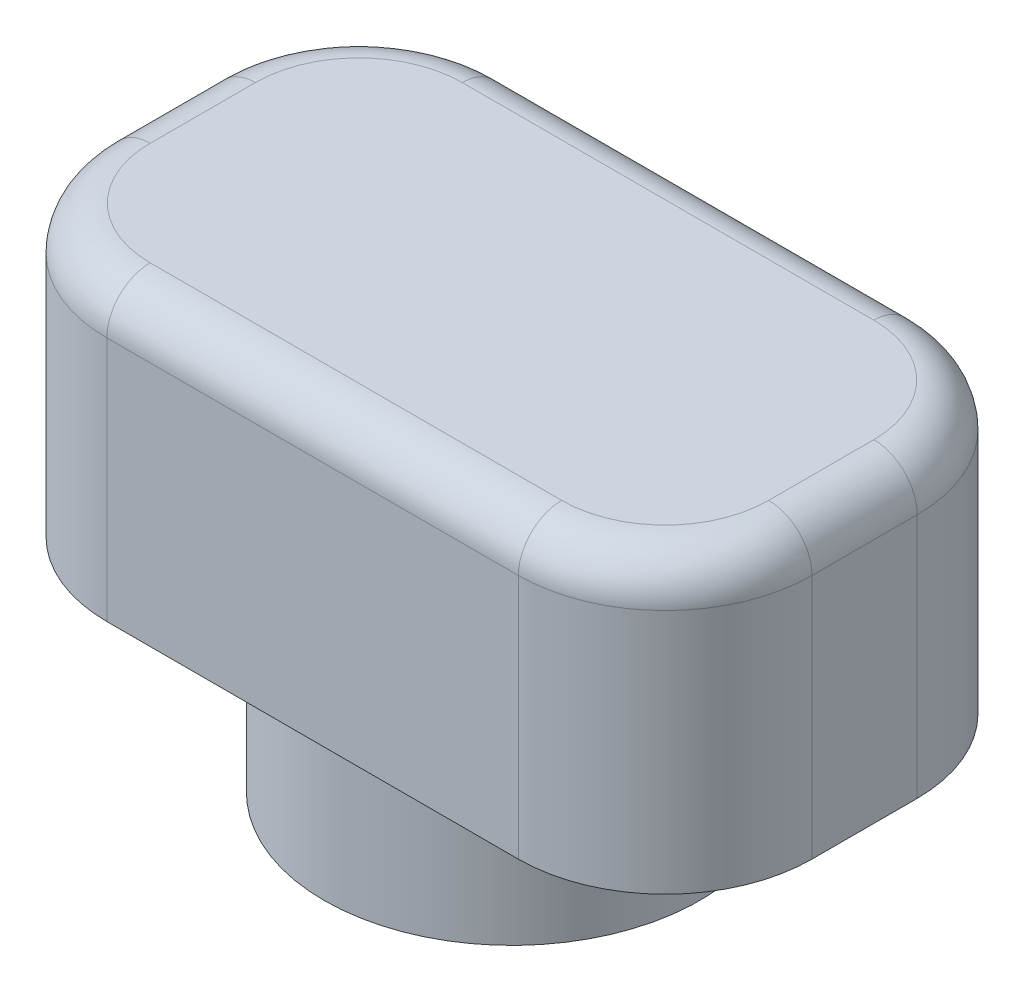
ISO-10303-21;
HEADER;
FILE_DESCRIPTION(('STEP AP214'),'2;1');
FILE_NAME('part.step','',(''),(''),'','','');
FILE_SCHEMA(('AUTOMOTIVE_DESIGN { 1 0 10303 214 1 1 1 1 }'));
ENDSEC;
DATA;
#1=APPLICATION_CONTEXT('core data for automotive mechanical design processes');
#2=APPLICATION_PROTOCOL_DEFINITION('international standard','automotive_design',2000,#1);
#3=PRODUCT_CONTEXT('',#1,'mechanical');
#4=PRODUCT('Part','Part','',(#3));
#5=PRODUCT_RELATED_PRODUCT_CATEGORY('part','',(#4));
#6=PRODUCT_DEFINITION_FORMATION('','',#4);
#7=PRODUCT_DEFINITION_CONTEXT('part definition',#1,'design');
#8=PRODUCT_DEFINITION('design','',#6,#7);
#9=PRODUCT_DEFINITION_SHAPE('','',#8);
#10=(LENGTH_UNIT() NAMED_UNIT(*) SI_UNIT(.MILLI.,.METRE.));
#11=(NAMED_UNIT(*) PLANE_ANGLE_UNIT() SI_UNIT($,.RADIAN.));
#12=(NAMED_UNIT(*) SI_UNIT($,.STERADIAN.) SOLID_ANGLE_UNIT());
#13=UNCERTAINTY_MEASURE_WITH_UNIT(LENGTH_MEASURE(1.E-05),#10,'distance_accuracy_value','');
#14=(GEOMETRIC_REPRESENTATION_CONTEXT(3) GLOBAL_UNCERTAINTY_ASSIGNED_CONTEXT((#13)) GLOBAL_UNIT_ASSIGNED_CONTEXT((#10,
#11,#12)) REPRESENTATION_CONTEXT('',''));
#15=CARTESIAN_POINT('',(0.,0.,0.));
#16=DIRECTION('',(0.,0.,1.));
#17=DIRECTION('',(1.,0.,0.));
#18=AXIS2_PLACEMENT_3D('',#15,#16,#17);
#19=CARTESIAN_POINT('',(0.,2.5,0.));
#20=DIRECTION('',(0.,-1.,0.));
#21=DIRECTION('',(0.,0.,-1.));
#22=AXIS2_PLACEMENT_3D('',#19,#20,#21);
#23=CYLINDRICAL_SURFACE('',#22,3.25);
#24=CARTESIAN_POINT('',(0.,2.5,0.));
#25=DIRECTION('',(0.,1.,0.));
#26=DIRECTION('',(0.,0.,1.));
#27=AXIS2_PLACEMENT_3D('',#24,#25,#26);
#28=CIRCLE('',#27,3.25);
#29=CARTESIAN_POINT('',(0.,2.5,3.25));
#30=VERTEX_POINT('',#29);
#31=EDGE_CURVE('E187',#30,#30,#28,.T.);
#32=ORIENTED_EDGE('',*,*,#31,.F.);
#33=EDGE_LOOP('',(#32));
#34=FACE_BOUND('',#33,.T.);
#35=CARTESIAN_POINT('',(0.,0.,0.));
#36=DIRECTION('',(0.,1.,0.));
#37=DIRECTION('',(0.,0.,1.));
#38=AXIS2_PLACEMENT_3D('',#35,#36,#37);
#39=CIRCLE('',#38,3.25);
#40=CARTESIAN_POINT('',(0.,0.,3.25));
#41=VERTEX_POINT('',#40);
#42=EDGE_CURVE('E183',#41,#41,#39,.T.);
#43=ORIENTED_EDGE('',*,*,#42,.T.);
#44=EDGE_LOOP('',(#43));
#45=FACE_BOUND('',#44,.T.);
#46=ADVANCED_FACE('F47',(#34,#45),#23,.T.);
#47=CARTESIAN_POINT('',(0.,0.,0.));
#48=DIRECTION('',(0.,1.,0.));
#49=DIRECTION('',(0.,0.,1.));
#50=AXIS2_PLACEMENT_3D('',#47,#48,#49);
#51=PLANE('',#50);
#52=CARTESIAN_POINT('',(0.,0.,0.));
#53=DIRECTION('',(0.,-1.,0.));
#54=DIRECTION('',(0.,0.,-1.));
#55=AXIS2_PLACEMENT_3D('',#52,#53,#54);
#56=CIRCLE('',#55,1.75);
#57=CARTESIAN_POINT('',(0.,0.,-1.75));
#58=VERTEX_POINT('',#57);
#59=EDGE_CURVE('E173',#58,#58,#56,.T.);
#60=ORIENTED_EDGE('',*,*,#59,.F.);
#61=EDGE_LOOP('',(#60));
#62=FACE_BOUND('',#61,.T.);
#63=ORIENTED_EDGE('',*,*,#42,.F.);
#64=EDGE_LOOP('',(#63));
#65=FACE_BOUND('',#64,.T.);
#66=ADVANCED_FACE('F354',(#62,#65),#51,.F.);
#67=CARTESIAN_POINT('',(0.,2.5,0.));
#68=DIRECTION('',(0.,-1.,0.));
#69=DIRECTION('',(0.,0.,-1.));
#70=AXIS2_PLACEMENT_3D('',#67,#68,#69);
#71=CYLINDRICAL_SURFACE('',#70,1.75);
#72=CARTESIAN_POINT('',(0.,2.5,0.));
#73=DIRECTION('',(0.,-1.,0.));
#74=DIRECTION('',(0.,0.,-1.));
#75=AXIS2_PLACEMENT_3D('',#72,#73,#74);
#76=CIRCLE('',#75,1.75);
#77=CARTESIAN_POINT('',(0.,2.5,-1.75));
#78=VERTEX_POINT('',#77);
#79=EDGE_CURVE('E179',#78,#78,#76,.T.);
#80=ORIENTED_EDGE('',*,*,#79,.F.);
#81=EDGE_LOOP('',(#80));
#82=FACE_BOUND('',#81,.T.);
#83=ORIENTED_EDGE('',*,*,#59,.T.);
#84=EDGE_LOOP('',(#83));
#85=FACE_BOUND('',#84,.T.);
#86=ADVANCED_FACE('F360',(#82,#85),#71,.F.);
#87=CARTESIAN_POINT('',(0.,2.5,0.));
#88=DIRECTION('',(0.,1.,0.));
#89=DIRECTION('',(0.,0.,1.));
#90=AXIS2_PLACEMENT_3D('',#87,#88,#89);
#91=PLANE('',#90);
#92=ORIENTED_EDGE('',*,*,#31,.T.);
#93=EDGE_LOOP('',(#92));
#94=FACE_BOUND('',#93,.T.);
#95=DIRECTION('',(0.,0.,1.));
#96=VECTOR('',#95,1.);
#97=CARTESIAN_POINT('',(-6.1,2.5,-3.45));
#98=LINE('',#97,#96);
#99=CARTESIAN_POINT('',(-6.1,2.5,-0.909999999999998));
#100=VERTEX_POINT('',#99);
#101=CARTESIAN_POINT('',(-6.1,2.5,0.910000000000001));
#102=VERTEX_POINT('',#101);
#103=EDGE_CURVE('E142',#100,#102,#98,.T.);
#104=ORIENTED_EDGE('',*,*,#103,.F.);
#105=CARTESIAN_POINT('',(-3.56,2.5,-0.909999999999999));
#106=DIRECTION('',(0.,1.,0.));
#107=DIRECTION('',(0.,0.,1.));
#108=AXIS2_PLACEMENT_3D('',#105,#106,#107);
#109=CIRCLE('',#108,2.54);
#110=CARTESIAN_POINT('',(-3.56,2.5,-3.45));
#111=VERTEX_POINT('',#110);
#112=EDGE_CURVE('E152',#100,#111,#109,.F.);
#113=ORIENTED_EDGE('',*,*,#112,.T.);
#114=DIRECTION('',(-1.,0.,0.));
#115=VECTOR('',#114,1.);
#116=CARTESIAN_POINT('',(-6.1,2.5,-3.45));
#117=LINE('',#116,#115);
#118=CARTESIAN_POINT('',(3.56,2.5,-3.45));
#119=VERTEX_POINT('',#118);
#120=EDGE_CURVE('E168',#119,#111,#117,.T.);
#121=ORIENTED_EDGE('',*,*,#120,.F.);
#122=CARTESIAN_POINT('',(3.56,2.5,-0.909999999999999));
#123=DIRECTION('',(0.,1.,0.));
#124=DIRECTION('',(0.,0.,1.));
#125=AXIS2_PLACEMENT_3D('',#122,#123,#124);
#126=CIRCLE('',#125,2.54);
#127=CARTESIAN_POINT('',(6.1,2.5,-0.909999999999999));
#128=VERTEX_POINT('',#127);
#129=EDGE_CURVE('E161',#119,#128,#126,.F.);
#130=ORIENTED_EDGE('',*,*,#129,.T.);
#131=DIRECTION('',(0.,0.,-1.));
#132=VECTOR('',#131,1.);
#133=CARTESIAN_POINT('',(6.1,2.5,-3.45));
#134=LINE('',#133,#132);
#135=CARTESIAN_POINT('',(6.1,2.5,0.910000000000001));
#136=VERTEX_POINT('',#135);
#137=EDGE_CURVE('E175',#136,#128,#134,.T.);
#138=ORIENTED_EDGE('',*,*,#137,.F.);
#139=CARTESIAN_POINT('',(3.56,2.5,0.910000000000001));
#140=DIRECTION('',(0.,1.,0.));
#141=DIRECTION('',(0.,0.,1.));
#142=AXIS2_PLACEMENT_3D('',#139,#140,#141);
#143=CIRCLE('',#142,2.54);
#144=CARTESIAN_POINT('',(3.56,2.5,3.45));
#145=VERTEX_POINT('',#144);
#146=EDGE_CURVE('E198',#136,#145,#143,.F.);
#147=ORIENTED_EDGE('',*,*,#146,.T.);
#148=DIRECTION('',(1.,0.,0.));
#149=VECTOR('',#148,1.);
#150=CARTESIAN_POINT('',(-6.1,2.5,3.45));
#151=LINE('',#150,#149);
#152=CARTESIAN_POINT('',(-3.56,2.5,3.45));
#153=VERTEX_POINT('',#152);
#154=EDGE_CURVE('E167',#153,#145,#151,.T.);
#155=ORIENTED_EDGE('',*,*,#154,.F.);
#156=CARTESIAN_POINT('',(-3.56,2.5,0.910000000000001));
#157=DIRECTION('',(0.,1.,0.));
#158=DIRECTION('',(0.,0.,1.));
#159=AXIS2_PLACEMENT_3D('',#156,#157,#158);
#160=CIRCLE('',#159,2.54);
#161=EDGE_CURVE('E148',#153,#102,#160,.F.);
#162=ORIENTED_EDGE('',*,*,#161,.T.);
#163=EDGE_LOOP('',(#104,#113,#121,#130,#138,#147,#155,#162));
#164=FACE_BOUND('',#163,.T.);
#165=ADVANCED_FACE('F163',(#94,#164),#91,.F.);
#166=CARTESIAN_POINT('',(0.,7.5,0.));
#167=DIRECTION('',(0.,1.,0.));
#168=DIRECTION('',(0.,0.,1.));
#169=AXIS2_PLACEMENT_3D('',#166,#167,#168);
#170=PLANE('',#169);
#171=CARTESIAN_POINT('',(3.56,7.5,0.910000000000001));
#172=DIRECTION('',(0.,1.,0.));
#173=DIRECTION('',(0.,0.,1.));
#174=AXIS2_PLACEMENT_3D('',#171,#172,#173);
#175=CIRCLE('',#174,1.79);
#176=CARTESIAN_POINT('',(3.56,7.5,2.7));
#177=VERTEX_POINT('',#176);
#178=CARTESIAN_POINT('',(5.35,7.5,0.910000000000001));
#179=VERTEX_POINT('',#178);
#180=EDGE_CURVE('E238',#177,#179,#175,.T.);
#181=ORIENTED_EDGE('',*,*,#180,.T.);
#182=DIRECTION('',(0.,0.,-1.));
#183=VECTOR('',#182,1.);
#184=CARTESIAN_POINT('',(5.35,7.5,-0.909999999999999));
#185=LINE('',#184,#183);
#186=CARTESIAN_POINT('',(5.35,7.5,-0.909999999999999));
#187=VERTEX_POINT('',#186);
#188=EDGE_CURVE('E241',#179,#187,#185,.T.);
#189=ORIENTED_EDGE('',*,*,#188,.T.);
#190=CARTESIAN_POINT('',(3.56,7.5,-0.909999999999999));
#191=DIRECTION('',(0.,1.,0.));
#192=DIRECTION('',(0.,0.,1.));
#193=AXIS2_PLACEMENT_3D('',#190,#191,#192);
#194=CIRCLE('',#193,1.79);
#195=CARTESIAN_POINT('',(3.56,7.5,-2.7));
#196=VERTEX_POINT('',#195);
#197=EDGE_CURVE('E235',#187,#196,#194,.T.);
#198=ORIENTED_EDGE('',*,*,#197,.T.);
#199=DIRECTION('',(-1.,0.,0.));
#200=VECTOR('',#199,1.);
#201=CARTESIAN_POINT('',(-3.56,7.5,-2.7));
#202=LINE('',#201,#200);
#203=CARTESIAN_POINT('',(-3.56,7.5,-2.7));
#204=VERTEX_POINT('',#203);
#205=EDGE_CURVE('E232',#196,#204,#202,.T.);
#206=ORIENTED_EDGE('',*,*,#205,.T.);
#207=CARTESIAN_POINT('',(-3.56,7.5,-0.909999999999999));
#208=DIRECTION('',(0.,1.,0.));
#209=DIRECTION('',(0.,0.,1.));
#210=AXIS2_PLACEMENT_3D('',#207,#208,#209);
#211=CIRCLE('',#210,1.79);
#212=CARTESIAN_POINT('',(-5.35,7.5,-0.909999999999999));
#213=VERTEX_POINT('',#212);
#214=EDGE_CURVE('E229',#204,#213,#211,.T.);
#215=ORIENTED_EDGE('',*,*,#214,.T.);
#216=DIRECTION('',(0.,0.,1.));
#217=VECTOR('',#216,1.);
#218=CARTESIAN_POINT('',(-5.35,7.5,0.910000000000001));
#219=LINE('',#218,#217);
#220=CARTESIAN_POINT('',(-5.35,7.5,0.910000000000001));
#221=VERTEX_POINT('',#220);
#222=EDGE_CURVE('E226',#213,#221,#219,.T.);
#223=ORIENTED_EDGE('',*,*,#222,.T.);
#224=CARTESIAN_POINT('',(-3.56,7.5,0.910000000000001));
#225=DIRECTION('',(0.,1.,0.));
#226=DIRECTION('',(0.,0.,1.));
#227=AXIS2_PLACEMENT_3D('',#224,#225,#226);
#228=CIRCLE('',#227,1.79);
#229=CARTESIAN_POINT('',(-3.56,7.5,2.7));
#230=VERTEX_POINT('',#229);
#231=EDGE_CURVE('E223',#221,#230,#228,.T.);
#232=ORIENTED_EDGE('',*,*,#231,.T.);
#233=DIRECTION('',(1.,0.,0.));
#234=VECTOR('',#233,1.);
#235=CARTESIAN_POINT('',(3.56,7.5,2.7));
#236=LINE('',#235,#234);
#237=EDGE_CURVE('E220',#230,#177,#236,.T.);
#238=ORIENTED_EDGE('',*,*,#237,.T.);
#239=EDGE_LOOP('',(#181,#189,#198,#206,#215,#223,#232,#238));
#240=FACE_BOUND('',#239,.T.);
#241=ADVANCED_FACE('F337',(#240),#170,.T.);
#242=CARTESIAN_POINT('',(-6.1,7.5,3.45));
#243=DIRECTION('',(0.,0.,-1.));
#244=DIRECTION('',(-1.,0.,0.));
#245=AXIS2_PLACEMENT_3D('',#242,#243,#244);
#246=PLANE('',#245);
#247=DIRECTION('',(0.,-1.,0.));
#248=VECTOR('',#247,1.);
#249=CARTESIAN_POINT('',(3.56,7.5,3.45));
#250=LINE('',#249,#248);
#251=CARTESIAN_POINT('',(3.56,6.75,3.45));
#252=VERTEX_POINT('',#251);
#253=EDGE_CURVE('E217',#145,#252,#250,.F.);
#254=ORIENTED_EDGE('',*,*,#253,.T.);
#255=DIRECTION('',(1.,0.,0.));
#256=VECTOR('',#255,1.);
#257=CARTESIAN_POINT('',(-3.56,6.75,3.45));
#258=LINE('',#257,#256);
#259=CARTESIAN_POINT('',(-3.56,6.75,3.45));
#260=VERTEX_POINT('',#259);
#261=EDGE_CURVE('E11',#252,#260,#258,.F.);
#262=ORIENTED_EDGE('',*,*,#261,.T.);
#263=DIRECTION('',(0.,-1.,0.));
#264=VECTOR('',#263,1.);
#265=CARTESIAN_POINT('',(-3.56,7.5,3.45));
#266=LINE('',#265,#264);
#267=EDGE_CURVE('E214',#260,#153,#266,.T.);
#268=ORIENTED_EDGE('',*,*,#267,.T.);
#269=ORIENTED_EDGE('',*,*,#154,.T.);
#270=EDGE_LOOP('',(#254,#262,#268,#269));
#271=FACE_BOUND('',#270,.T.);
#272=ADVANCED_FACE('F324',(#271),#246,.F.);
#273=CARTESIAN_POINT('',(-6.1,7.5,-3.45));
#274=DIRECTION('',(1.,0.,0.));
#275=DIRECTION('',(0.,0.,-1.));
#276=AXIS2_PLACEMENT_3D('',#273,#274,#275);
#277=PLANE('',#276);
#278=DIRECTION('',(0.,-1.,0.));
#279=VECTOR('',#278,1.);
#280=CARTESIAN_POINT('',(-6.1,7.5,0.910000000000001));
#281=LINE('',#280,#279);
#282=CARTESIAN_POINT('',(-6.1,6.75,0.910000000000001));
#283=VERTEX_POINT('',#282);
#284=EDGE_CURVE('E149',#102,#283,#281,.F.);
#285=ORIENTED_EDGE('',*,*,#284,.T.);
#286=DIRECTION('',(0.,0.,1.));
#287=VECTOR('',#286,1.);
#288=CARTESIAN_POINT('',(-6.1,6.75,-0.909999999999998));
#289=LINE('',#288,#287);
#290=CARTESIAN_POINT('',(-6.1,6.75,-0.909999999999998));
#291=VERTEX_POINT('',#290);
#292=EDGE_CURVE('E144',#283,#291,#289,.F.);
#293=ORIENTED_EDGE('',*,*,#292,.T.);
#294=DIRECTION('',(0.,-1.,0.));
#295=VECTOR('',#294,1.);
#296=CARTESIAN_POINT('',(-6.1,7.5,-0.909999999999998));
#297=LINE('',#296,#295);
#298=EDGE_CURVE('E138',#291,#100,#297,.T.);
#299=ORIENTED_EDGE('',*,*,#298,.T.);
#300=ORIENTED_EDGE('',*,*,#103,.T.);
#301=EDGE_LOOP('',(#285,#293,#299,#300));
#302=FACE_BOUND('',#301,.T.);
#303=ADVANCED_FACE('F140',(#302),#277,.F.);
#304=CARTESIAN_POINT('',(-6.1,7.5,-3.45));
#305=DIRECTION('',(0.,0.,1.));
#306=DIRECTION('',(1.,0.,0.));
#307=AXIS2_PLACEMENT_3D('',#304,#305,#306);
#308=PLANE('',#307);
#309=DIRECTION('',(0.,-1.,0.));
#310=VECTOR('',#309,1.);
#311=CARTESIAN_POINT('',(-3.56,7.5,-3.45));
#312=LINE('',#311,#310);
#313=CARTESIAN_POINT('',(-3.56,6.75,-3.45));
#314=VERTEX_POINT('',#313);
#315=EDGE_CURVE('E155',#111,#314,#312,.F.);
#316=ORIENTED_EDGE('',*,*,#315,.T.);
#317=DIRECTION('',(-1.,0.,0.));
#318=VECTOR('',#317,1.);
#319=CARTESIAN_POINT('',(3.56,6.75,-3.45));
#320=LINE('',#319,#318);
#321=CARTESIAN_POINT('',(3.56,6.75,-3.45));
#322=VERTEX_POINT('',#321);
#323=EDGE_CURVE('E255',#314,#322,#320,.F.);
#324=ORIENTED_EDGE('',*,*,#323,.T.);
#325=DIRECTION('',(0.,-1.,0.));
#326=VECTOR('',#325,1.);
#327=CARTESIAN_POINT('',(3.56,7.5,-3.45));
#328=LINE('',#327,#326);
#329=EDGE_CURVE('E160',#322,#119,#328,.T.);
#330=ORIENTED_EDGE('',*,*,#329,.T.);
#331=ORIENTED_EDGE('',*,*,#120,.T.);
#332=EDGE_LOOP('',(#316,#324,#330,#331));
#333=FACE_BOUND('',#332,.T.);
#334=ADVANCED_FACE('F332',(#333),#308,.F.);
#335=CARTESIAN_POINT('',(6.1,7.5,-3.45));
#336=DIRECTION('',(-1.,0.,0.));
#337=DIRECTION('',(0.,0.,1.));
#338=AXIS2_PLACEMENT_3D('',#335,#336,#337);
#339=PLANE('',#338);
#340=DIRECTION('',(0.,-1.,0.));
#341=VECTOR('',#340,1.);
#342=CARTESIAN_POINT('',(6.1,7.5,-0.909999999999999));
#343=LINE('',#342,#341);
#344=CARTESIAN_POINT('',(6.1,6.75,-0.909999999999999));
#345=VERTEX_POINT('',#344);
#346=EDGE_CURVE('E210',#128,#345,#343,.F.);
#347=ORIENTED_EDGE('',*,*,#346,.T.);
#348=DIRECTION('',(0.,0.,-1.));
#349=VECTOR('',#348,1.);
#350=CARTESIAN_POINT('',(6.1,6.75,0.910000000000001));
#351=LINE('',#350,#349);
#352=CARTESIAN_POINT('',(6.1,6.75,0.910000000000001));
#353=VERTEX_POINT('',#352);
#354=EDGE_CURVE('E245',#345,#353,#351,.F.);
#355=ORIENTED_EDGE('',*,*,#354,.T.);
#356=DIRECTION('',(0.,-1.,0.));
#357=VECTOR('',#356,1.);
#358=CARTESIAN_POINT('',(6.1,7.5,0.910000000000001));
#359=LINE('',#358,#357);
#360=EDGE_CURVE('E207',#353,#136,#359,.T.);
#361=ORIENTED_EDGE('',*,*,#360,.T.);
#362=ORIENTED_EDGE('',*,*,#137,.T.);
#363=EDGE_LOOP('',(#347,#355,#361,#362));
#364=FACE_BOUND('',#363,.T.);
#365=ADVANCED_FACE('F302',(#364),#339,.F.);
#366=ORIENTED_EDGE('',*,*,#79,.T.);
#367=EDGE_LOOP('',(#366));
#368=FACE_BOUND('',#367,.T.);
#369=ADVANCED_FACE('F369',(#368),#91,.F.);
#370=CARTESIAN_POINT('',(-3.56,7.5,-0.909999999999999));
#371=DIRECTION('',(0.,-1.,0.));
#372=DIRECTION('',(0.,0.,-1.));
#373=AXIS2_PLACEMENT_3D('',#370,#371,#372);
#374=CYLINDRICAL_SURFACE('',#373,2.54);
#375=ORIENTED_EDGE('',*,*,#298,.F.);
#376=CARTESIAN_POINT('',(-3.56,6.75,-0.909999999999999));
#377=DIRECTION('',(0.,1.,0.));
#378=DIRECTION('',(0.,0.,1.));
#379=AXIS2_PLACEMENT_3D('',#376,#377,#378);
#380=CIRCLE('',#379,2.54);
#381=EDGE_CURVE('E258',#291,#314,#380,.F.);
#382=ORIENTED_EDGE('',*,*,#381,.T.);
#383=ORIENTED_EDGE('',*,*,#315,.F.);
#384=ORIENTED_EDGE('',*,*,#112,.F.);
#385=EDGE_LOOP('',(#375,#382,#383,#384));
#386=FACE_BOUND('',#385,.T.);
#387=ADVANCED_FACE('F153',(#386),#374,.T.);
#388=CARTESIAN_POINT('',(3.56,7.5,-0.909999999999999));
#389=DIRECTION('',(0.,-1.,0.));
#390=DIRECTION('',(0.,0.,-1.));
#391=AXIS2_PLACEMENT_3D('',#388,#389,#390);
#392=CYLINDRICAL_SURFACE('',#391,2.54);
#393=ORIENTED_EDGE('',*,*,#329,.F.);
#394=CARTESIAN_POINT('',(3.56,6.75,-0.909999999999999));
#395=DIRECTION('',(0.,1.,0.));
#396=DIRECTION('',(0.,0.,1.));
#397=AXIS2_PLACEMENT_3D('',#394,#395,#396);
#398=CIRCLE('',#397,2.54);
#399=EDGE_CURVE('E252',#322,#345,#398,.F.);
#400=ORIENTED_EDGE('',*,*,#399,.T.);
#401=ORIENTED_EDGE('',*,*,#346,.F.);
#402=ORIENTED_EDGE('',*,*,#129,.F.);
#403=EDGE_LOOP('',(#393,#400,#401,#402));
#404=FACE_BOUND('',#403,.T.);
#405=ADVANCED_FACE('F309',(#404),#392,.T.);
#406=CARTESIAN_POINT('',(3.56,7.5,0.910000000000001));
#407=DIRECTION('',(0.,-1.,0.));
#408=DIRECTION('',(0.,0.,-1.));
#409=AXIS2_PLACEMENT_3D('',#406,#407,#408);
#410=CYLINDRICAL_SURFACE('',#409,2.54);
#411=ORIENTED_EDGE('',*,*,#360,.F.);
#412=CARTESIAN_POINT('',(3.56,6.75,0.910000000000001));
#413=DIRECTION('',(0.,1.,0.));
#414=DIRECTION('',(0.,0.,1.));
#415=AXIS2_PLACEMENT_3D('',#412,#413,#414);
#416=CIRCLE('',#415,2.54);
#417=EDGE_CURVE('E249',#353,#252,#416,.F.);
#418=ORIENTED_EDGE('',*,*,#417,.T.);
#419=ORIENTED_EDGE('',*,*,#253,.F.);
#420=ORIENTED_EDGE('',*,*,#146,.F.);
#421=EDGE_LOOP('',(#411,#418,#419,#420));
#422=FACE_BOUND('',#421,.T.);
#423=ADVANCED_FACE('F322',(#422),#410,.T.);
#424=CARTESIAN_POINT('',(-3.56,7.5,0.910000000000001));
#425=DIRECTION('',(0.,-1.,0.));
#426=DIRECTION('',(0.,0.,-1.));
#427=AXIS2_PLACEMENT_3D('',#424,#425,#426);
#428=CYLINDRICAL_SURFACE('',#427,2.54);
#429=ORIENTED_EDGE('',*,*,#267,.F.);
#430=CARTESIAN_POINT('',(-3.56,6.75,0.910000000000001));
#431=DIRECTION('',(0.,1.,0.));
#432=DIRECTION('',(0.,0.,1.));
#433=AXIS2_PLACEMENT_3D('',#430,#431,#432);
#434=CIRCLE('',#433,2.54);
#435=EDGE_CURVE('E57',#260,#283,#434,.F.);
#436=ORIENTED_EDGE('',*,*,#435,.T.);
#437=ORIENTED_EDGE('',*,*,#284,.F.);
#438=ORIENTED_EDGE('',*,*,#161,.F.);
#439=EDGE_LOOP('',(#429,#436,#437,#438));
#440=FACE_BOUND('',#439,.T.);
#441=ADVANCED_FACE('F325',(#440),#428,.T.);
#442=CARTESIAN_POINT('',(-5.35,6.75,0.));
#443=DIRECTION('',(0.,0.,-1.));
#444=DIRECTION('',(-1.,0.,0.));
#445=AXIS2_PLACEMENT_3D('',#442,#443,#444);
#446=CYLINDRICAL_SURFACE('',#445,0.75);
#447=CARTESIAN_POINT('',(-5.35,6.75,-0.909999999999999));
#448=DIRECTION('',(0.,0.,-1.));
#449=DIRECTION('',(-1.,0.,0.));
#450=AXIS2_PLACEMENT_3D('',#447,#448,#449);
#451=CIRCLE('',#450,0.75);
#452=EDGE_CURVE('E286',#291,#213,#451,.T.);
#453=ORIENTED_EDGE('',*,*,#452,.F.);
#454=ORIENTED_EDGE('',*,*,#292,.F.);
#455=CARTESIAN_POINT('',(-5.35,6.75,0.910000000000001));
#456=DIRECTION('',(0.,0.,1.));
#457=DIRECTION('',(1.,0.,0.));
#458=AXIS2_PLACEMENT_3D('',#455,#456,#457);
#459=CIRCLE('',#458,0.75);
#460=EDGE_CURVE('E51',#221,#283,#459,.T.);
#461=ORIENTED_EDGE('',*,*,#460,.F.);
#462=ORIENTED_EDGE('',*,*,#222,.F.);
#463=EDGE_LOOP('',(#453,#454,#461,#462));
#464=FACE_BOUND('',#463,.T.);
#465=ADVANCED_FACE('F49',(#464),#446,.T.);
#466=CARTESIAN_POINT('',(-3.56,6.75,0.910000000000001));
#467=DIRECTION('',(0.,1.,0.));
#468=DIRECTION('',(0.,0.,1.));
#469=AXIS2_PLACEMENT_3D('',#466,#467,#468);
#470=TOROIDAL_SURFACE('',#469,1.79,0.75);
#471=ORIENTED_EDGE('',*,*,#460,.T.);
#472=ORIENTED_EDGE('',*,*,#435,.F.);
#473=CARTESIAN_POINT('',(-3.56,6.75,2.7));
#474=DIRECTION('',(1.,0.,0.));
#475=DIRECTION('',(0.,0.,-1.));
#476=AXIS2_PLACEMENT_3D('',#473,#474,#475);
#477=CIRCLE('',#476,0.75);
#478=EDGE_CURVE('E283',#230,#260,#477,.T.);
#479=ORIENTED_EDGE('',*,*,#478,.F.);
#480=ORIENTED_EDGE('',*,*,#231,.F.);
#481=EDGE_LOOP('',(#471,#472,#479,#480));
#482=FACE_BOUND('',#481,.T.);
#483=ADVANCED_FACE('F346',(#482),#470,.T.);
#484=CARTESIAN_POINT('',(-3.56,6.75,-0.909999999999999));
#485=DIRECTION('',(0.,1.,0.));
#486=DIRECTION('',(0.,0.,1.));
#487=AXIS2_PLACEMENT_3D('',#484,#485,#486);
#488=TOROIDAL_SURFACE('',#487,1.79,0.75);
#489=ORIENTED_EDGE('',*,*,#452,.T.);
#490=ORIENTED_EDGE('',*,*,#214,.F.);
#491=CARTESIAN_POINT('',(-3.56,6.75,-2.7));
#492=DIRECTION('',(1.,0.,0.));
#493=DIRECTION('',(0.,0.,-1.));
#494=AXIS2_PLACEMENT_3D('',#491,#492,#493);
#495=CIRCLE('',#494,0.75);
#496=EDGE_CURVE('E279',#314,#204,#495,.T.);
#497=ORIENTED_EDGE('',*,*,#496,.F.);
#498=ORIENTED_EDGE('',*,*,#381,.F.);
#499=EDGE_LOOP('',(#489,#490,#497,#498));
#500=FACE_BOUND('',#499,.T.);
#501=ADVANCED_FACE('F329',(#500),#488,.T.);
#502=CARTESIAN_POINT('',(0.,6.75,2.7));
#503=DIRECTION('',(-1.,0.,0.));
#504=DIRECTION('',(0.,0.,1.));
#505=AXIS2_PLACEMENT_3D('',#502,#503,#504);
#506=CYLINDRICAL_SURFACE('',#505,0.75);
#507=ORIENTED_EDGE('',*,*,#478,.T.);
#508=ORIENTED_EDGE('',*,*,#261,.F.);
#509=CARTESIAN_POINT('',(3.56,6.75,2.7));
#510=DIRECTION('',(1.,0.,0.));
#511=DIRECTION('',(0.,0.,-1.));
#512=AXIS2_PLACEMENT_3D('',#509,#510,#511);
#513=CIRCLE('',#512,0.75);
#514=EDGE_CURVE('E275',#177,#252,#513,.T.);
#515=ORIENTED_EDGE('',*,*,#514,.F.);
#516=ORIENTED_EDGE('',*,*,#237,.F.);
#517=EDGE_LOOP('',(#507,#508,#515,#516));
#518=FACE_BOUND('',#517,.T.);
#519=ADVANCED_FACE('F344',(#518),#506,.T.);
#520=CARTESIAN_POINT('',(0.,6.75,-2.7));
#521=DIRECTION('',(1.,0.,0.));
#522=DIRECTION('',(0.,0.,-1.));
#523=AXIS2_PLACEMENT_3D('',#520,#521,#522);
#524=CYLINDRICAL_SURFACE('',#523,0.75);
#525=ORIENTED_EDGE('',*,*,#496,.T.);
#526=ORIENTED_EDGE('',*,*,#205,.F.);
#527=CARTESIAN_POINT('',(3.56,6.75,-2.7));
#528=DIRECTION('',(1.,0.,0.));
#529=DIRECTION('',(0.,0.,-1.));
#530=AXIS2_PLACEMENT_3D('',#527,#528,#529);
#531=CIRCLE('',#530,0.75);
#532=EDGE_CURVE('E271',#322,#196,#531,.T.);
#533=ORIENTED_EDGE('',*,*,#532,.F.);
#534=ORIENTED_EDGE('',*,*,#323,.F.);
#535=EDGE_LOOP('',(#525,#526,#533,#534));
#536=FACE_BOUND('',#535,.T.);
#537=ADVANCED_FACE('F334',(#536),#524,.T.);
#538=CARTESIAN_POINT('',(3.56,6.75,0.910000000000001));
#539=DIRECTION('',(0.,1.,0.));
#540=DIRECTION('',(0.,0.,1.));
#541=AXIS2_PLACEMENT_3D('',#538,#539,#540);
#542=TOROIDAL_SURFACE('',#541,1.79,0.75);
#543=ORIENTED_EDGE('',*,*,#514,.T.);
#544=ORIENTED_EDGE('',*,*,#417,.F.);
#545=CARTESIAN_POINT('',(5.35,6.75,0.910000000000001));
#546=DIRECTION('',(0.,0.,-1.));
#547=DIRECTION('',(-1.,0.,0.));
#548=AXIS2_PLACEMENT_3D('',#545,#546,#547);
#549=CIRCLE('',#548,0.75);
#550=EDGE_CURVE('E268',#179,#353,#549,.T.);
#551=ORIENTED_EDGE('',*,*,#550,.F.);
#552=ORIENTED_EDGE('',*,*,#180,.F.);
#553=EDGE_LOOP('',(#543,#544,#551,#552));
#554=FACE_BOUND('',#553,.T.);
#555=ADVANCED_FACE('F342',(#554),#542,.T.);
#556=CARTESIAN_POINT('',(3.56,6.75,-0.909999999999999));
#557=DIRECTION('',(0.,1.,0.));
#558=DIRECTION('',(0.,0.,1.));
#559=AXIS2_PLACEMENT_3D('',#556,#557,#558);
#560=TOROIDAL_SURFACE('',#559,1.79,0.75);
#561=ORIENTED_EDGE('',*,*,#532,.T.);
#562=ORIENTED_EDGE('',*,*,#197,.F.);
#563=CARTESIAN_POINT('',(5.35,6.75,-0.909999999999999));
#564=DIRECTION('',(0.,0.,1.));
#565=DIRECTION('',(1.,0.,0.));
#566=AXIS2_PLACEMENT_3D('',#563,#564,#565);
#567=CIRCLE('',#566,0.75);
#568=EDGE_CURVE('E265',#345,#187,#567,.T.);
#569=ORIENTED_EDGE('',*,*,#568,.F.);
#570=ORIENTED_EDGE('',*,*,#399,.F.);
#571=EDGE_LOOP('',(#561,#562,#569,#570));
#572=FACE_BOUND('',#571,.T.);
#573=ADVANCED_FACE('F314',(#572),#560,.T.);
#574=CARTESIAN_POINT('',(5.35,6.75,0.));
#575=DIRECTION('',(0.,0.,1.));
#576=DIRECTION('',(1.,0.,0.));
#577=AXIS2_PLACEMENT_3D('',#574,#575,#576);
#578=CYLINDRICAL_SURFACE('',#577,0.75);
#579=ORIENTED_EDGE('',*,*,#550,.T.);
#580=ORIENTED_EDGE('',*,*,#354,.F.);
#581=ORIENTED_EDGE('',*,*,#568,.T.);
#582=ORIENTED_EDGE('',*,*,#188,.F.);
#583=EDGE_LOOP('',(#579,#580,#581,#582));
#584=FACE_BOUND('',#583,.T.);
#585=ADVANCED_FACE('F318',(#584),#578,.T.);
#586=CLOSED_SHELL('',(#46,#66,#86,#165,#241,#272,#303,#334,#365,#369,#387,#405,#423,#441,#465,
#483,#501,#519,#537,#555,#573,#585));
#587=MANIFOLD_SOLID_BREP('B2',#586);
#588=ADVANCED_BREP_SHAPE_REPRESENTATION('',(#18,#587),#14);
#589=SHAPE_DEFINITION_REPRESENTATION(#9,#588);
ENDSEC;
END-ISO-10303-21;
